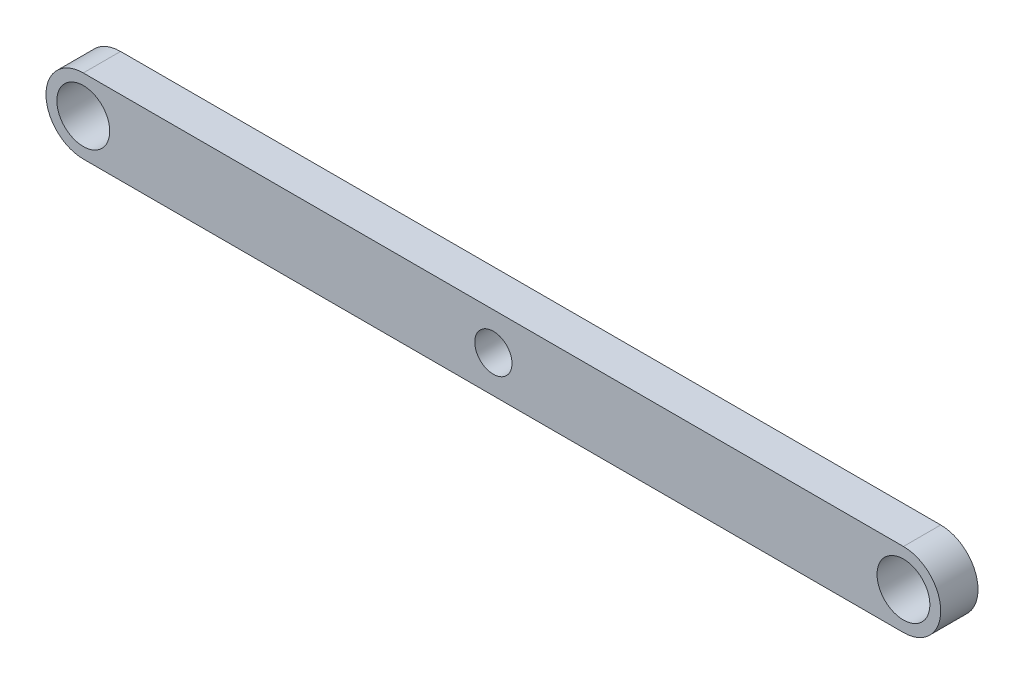
ISO-10303-21;
HEADER;
FILE_DESCRIPTION(('STEP AP214'),'2;1');
FILE_NAME('part.step','',(''),(''),'','','');
FILE_SCHEMA(('AUTOMOTIVE_DESIGN { 1 0 10303 214 1 1 1 1 }'));
ENDSEC;
DATA;
#1=APPLICATION_CONTEXT('core data for automotive mechanical design processes');
#2=APPLICATION_PROTOCOL_DEFINITION('international standard','automotive_design',2000,#1);
#3=PRODUCT_CONTEXT('',#1,'mechanical');
#4=PRODUCT('Part','Part','',(#3));
#5=PRODUCT_RELATED_PRODUCT_CATEGORY('part','',(#4));
#6=PRODUCT_DEFINITION_FORMATION('','',#4);
#7=PRODUCT_DEFINITION_CONTEXT('part definition',#1,'design');
#8=PRODUCT_DEFINITION('design','',#6,#7);
#9=PRODUCT_DEFINITION_SHAPE('','',#8);
#10=(LENGTH_UNIT() NAMED_UNIT(*) SI_UNIT(.MILLI.,.METRE.));
#11=(NAMED_UNIT(*) PLANE_ANGLE_UNIT() SI_UNIT($,.RADIAN.));
#12=(NAMED_UNIT(*) SI_UNIT($,.STERADIAN.) SOLID_ANGLE_UNIT());
#13=UNCERTAINTY_MEASURE_WITH_UNIT(LENGTH_MEASURE(1.E-05),#10,'distance_accuracy_value','');
#14=(GEOMETRIC_REPRESENTATION_CONTEXT(3) GLOBAL_UNCERTAINTY_ASSIGNED_CONTEXT((#13)) GLOBAL_UNIT_ASSIGNED_CONTEXT((#10,
#11,#12)) REPRESENTATION_CONTEXT('',''));
#15=CARTESIAN_POINT('',(0.,0.,0.));
#16=DIRECTION('',(0.,0.,1.));
#17=DIRECTION('',(1.,0.,0.));
#18=AXIS2_PLACEMENT_3D('',#15,#16,#17);
#19=CARTESIAN_POINT('',(-69.85,0.,6.35));
#20=DIRECTION('',(0.,0.,1.));
#21=DIRECTION('',(1.,0.,0.));
#22=AXIS2_PLACEMENT_3D('',#19,#20,#21);
#23=PLANE('',#22);
#24=CARTESIAN_POINT('',(69.85,0.,6.35));
#25=DIRECTION('',(0.,0.,1.));
#26=DIRECTION('',(1.,0.,0.));
#27=AXIS2_PLACEMENT_3D('',#24,#25,#26);
#28=CIRCLE('',#27,4.50000000000002);
#29=CARTESIAN_POINT('',(74.35,0.,6.35));
#30=VERTEX_POINT('',#29);
#31=EDGE_CURVE('E138',#30,#30,#28,.T.);
#32=ORIENTED_EDGE('',*,*,#31,.F.);
#33=EDGE_LOOP('',(#32));
#34=FACE_BOUND('',#33,.T.);
#35=CARTESIAN_POINT('',(-69.85,0.,6.35));
#36=DIRECTION('',(0.,0.,1.));
#37=DIRECTION('',(1.,0.,0.));
#38=AXIS2_PLACEMENT_3D('',#35,#36,#37);
#39=CIRCLE('',#38,6.35);
#40=CARTESIAN_POINT('',(-69.85,6.35,6.35));
#41=VERTEX_POINT('',#40);
#42=CARTESIAN_POINT('',(-69.85,-6.35,6.35));
#43=VERTEX_POINT('',#42);
#44=EDGE_CURVE('E96',#41,#43,#39,.T.);
#45=ORIENTED_EDGE('',*,*,#44,.T.);
#46=DIRECTION('',(1.,0.,0.));
#47=VECTOR('',#46,1.);
#48=CARTESIAN_POINT('',(-69.85,-6.35,6.35));
#49=LINE('',#48,#47);
#50=CARTESIAN_POINT('',(69.85,-6.34999999999997,6.35));
#51=VERTEX_POINT('',#50);
#52=EDGE_CURVE('E91',#43,#51,#49,.T.);
#53=ORIENTED_EDGE('',*,*,#52,.T.);
#54=CARTESIAN_POINT('',(69.85,0.,6.35));
#55=DIRECTION('',(0.,0.,1.));
#56=DIRECTION('',(1.,0.,0.));
#57=AXIS2_PLACEMENT_3D('',#54,#55,#56);
#58=CIRCLE('',#57,6.35);
#59=CARTESIAN_POINT('',(69.85,6.35000000000003,6.35));
#60=VERTEX_POINT('',#59);
#61=EDGE_CURVE('E94',#51,#60,#58,.T.);
#62=ORIENTED_EDGE('',*,*,#61,.T.);
#63=DIRECTION('',(-1.,0.,0.));
#64=VECTOR('',#63,1.);
#65=CARTESIAN_POINT('',(-69.85,6.35,6.35));
#66=LINE('',#65,#64);
#67=EDGE_CURVE('E61',#60,#41,#66,.T.);
#68=ORIENTED_EDGE('',*,*,#67,.T.);
#69=EDGE_LOOP('',(#45,#53,#62,#68));
#70=FACE_BOUND('',#69,.T.);
#71=CARTESIAN_POINT('',(-69.85,0.,6.35));
#72=DIRECTION('',(0.,0.,1.));
#73=DIRECTION('',(1.,0.,0.));
#74=AXIS2_PLACEMENT_3D('',#71,#72,#73);
#75=CIRCLE('',#74,4.5);
#76=CARTESIAN_POINT('',(-65.35,0.,6.35));
#77=VERTEX_POINT('',#76);
#78=EDGE_CURVE('E116',#77,#77,#75,.T.);
#79=ORIENTED_EDGE('',*,*,#78,.F.);
#80=EDGE_LOOP('',(#79));
#81=FACE_BOUND('',#80,.T.);
#82=CARTESIAN_POINT('',(0.,0.,6.35));
#83=DIRECTION('',(0.,0.,1.));
#84=DIRECTION('',(1.,0.,0.));
#85=AXIS2_PLACEMENT_3D('',#82,#83,#84);
#86=CIRCLE('',#85,3.175);
#87=CARTESIAN_POINT('',(3.175,0.,6.35));
#88=VERTEX_POINT('',#87);
#89=EDGE_CURVE('E146',#88,#88,#86,.T.);
#90=ORIENTED_EDGE('',*,*,#89,.F.);
#91=EDGE_LOOP('',(#90));
#92=FACE_BOUND('',#91,.T.);
#93=ADVANCED_FACE('F43',(#34,#70,#81,#92),#23,.T.);
#94=CARTESIAN_POINT('',(-69.85,0.,0.));
#95=DIRECTION('',(0.,0.,1.));
#96=DIRECTION('',(1.,0.,0.));
#97=AXIS2_PLACEMENT_3D('',#94,#95,#96);
#98=PLANE('',#97);
#99=CARTESIAN_POINT('',(-69.85,0.,0.));
#100=DIRECTION('',(0.,0.,1.));
#101=DIRECTION('',(1.,0.,0.));
#102=AXIS2_PLACEMENT_3D('',#99,#100,#101);
#103=CIRCLE('',#102,6.35);
#104=CARTESIAN_POINT('',(-69.85,6.35,0.));
#105=VERTEX_POINT('',#104);
#106=CARTESIAN_POINT('',(-69.85,-6.35,0.));
#107=VERTEX_POINT('',#106);
#108=EDGE_CURVE('E112',#105,#107,#103,.T.);
#109=ORIENTED_EDGE('',*,*,#108,.F.);
#110=DIRECTION('',(-1.,0.,0.));
#111=VECTOR('',#110,1.);
#112=CARTESIAN_POINT('',(-69.85,6.35,0.));
#113=LINE('',#112,#111);
#114=CARTESIAN_POINT('',(69.85,6.35000000000003,0.));
#115=VERTEX_POINT('',#114);
#116=EDGE_CURVE('E84',#115,#105,#113,.T.);
#117=ORIENTED_EDGE('',*,*,#116,.F.);
#118=CARTESIAN_POINT('',(69.85,0.,0.));
#119=DIRECTION('',(0.,0.,1.));
#120=DIRECTION('',(1.,0.,0.));
#121=AXIS2_PLACEMENT_3D('',#118,#119,#120);
#122=CIRCLE('',#121,6.35);
#123=CARTESIAN_POINT('',(69.85,-6.34999999999997,0.));
#124=VERTEX_POINT('',#123);
#125=EDGE_CURVE('E78',#124,#115,#122,.T.);
#126=ORIENTED_EDGE('',*,*,#125,.F.);
#127=DIRECTION('',(1.,0.,0.));
#128=VECTOR('',#127,1.);
#129=CARTESIAN_POINT('',(-69.85,-6.35,0.));
#130=LINE('',#129,#128);
#131=EDGE_CURVE('E101',#107,#124,#130,.T.);
#132=ORIENTED_EDGE('',*,*,#131,.F.);
#133=EDGE_LOOP('',(#109,#117,#126,#132));
#134=FACE_BOUND('',#133,.T.);
#135=CARTESIAN_POINT('',(-69.85,0.,0.));
#136=DIRECTION('',(0.,0.,1.));
#137=DIRECTION('',(1.,0.,0.));
#138=AXIS2_PLACEMENT_3D('',#135,#136,#137);
#139=CIRCLE('',#138,4.5);
#140=CARTESIAN_POINT('',(-65.35,0.,0.));
#141=VERTEX_POINT('',#140);
#142=EDGE_CURVE('E134',#141,#141,#139,.T.);
#143=ORIENTED_EDGE('',*,*,#142,.T.);
#144=EDGE_LOOP('',(#143));
#145=FACE_BOUND('',#144,.T.);
#146=CARTESIAN_POINT('',(69.85,0.,0.));
#147=DIRECTION('',(0.,0.,1.));
#148=DIRECTION('',(1.,0.,0.));
#149=AXIS2_PLACEMENT_3D('',#146,#147,#148);
#150=CIRCLE('',#149,4.50000000000002);
#151=CARTESIAN_POINT('',(74.35,0.,0.));
#152=VERTEX_POINT('',#151);
#153=EDGE_CURVE('E142',#152,#152,#150,.T.);
#154=ORIENTED_EDGE('',*,*,#153,.T.);
#155=EDGE_LOOP('',(#154));
#156=FACE_BOUND('',#155,.T.);
#157=CARTESIAN_POINT('',(0.,0.,0.));
#158=DIRECTION('',(0.,0.,1.));
#159=DIRECTION('',(1.,0.,0.));
#160=AXIS2_PLACEMENT_3D('',#157,#158,#159);
#161=CIRCLE('',#160,3.175);
#162=CARTESIAN_POINT('',(3.175,0.,0.));
#163=VERTEX_POINT('',#162);
#164=EDGE_CURVE('E150',#163,#163,#161,.T.);
#165=ORIENTED_EDGE('',*,*,#164,.T.);
#166=EDGE_LOOP('',(#165));
#167=FACE_BOUND('',#166,.T.);
#168=ADVANCED_FACE('F129',(#134,#145,#156,#167),#98,.F.);
#169=CARTESIAN_POINT('',(-69.85,0.,6.35));
#170=DIRECTION('',(0.,0.,-1.));
#171=DIRECTION('',(-1.,0.,0.));
#172=AXIS2_PLACEMENT_3D('',#169,#170,#171);
#173=CYLINDRICAL_SURFACE('',#172,6.35);
#174=ORIENTED_EDGE('',*,*,#108,.T.);
#175=DIRECTION('',(0.,0.,-1.));
#176=VECTOR('',#175,1.);
#177=CARTESIAN_POINT('',(-69.85,-6.35,6.35));
#178=LINE('',#177,#176);
#179=EDGE_CURVE('E11',#43,#107,#178,.T.);
#180=ORIENTED_EDGE('',*,*,#179,.F.);
#181=ORIENTED_EDGE('',*,*,#44,.F.);
#182=DIRECTION('',(0.,0.,-1.));
#183=VECTOR('',#182,1.);
#184=CARTESIAN_POINT('',(-69.85,6.35,6.35));
#185=LINE('',#184,#183);
#186=EDGE_CURVE('E108',#41,#105,#185,.T.);
#187=ORIENTED_EDGE('',*,*,#186,.T.);
#188=EDGE_LOOP('',(#174,#180,#181,#187));
#189=FACE_BOUND('',#188,.T.);
#190=ADVANCED_FACE('F45',(#189),#173,.T.);
#191=CARTESIAN_POINT('',(-69.85,-6.35,6.35));
#192=DIRECTION('',(0.,1.,0.));
#193=DIRECTION('',(-1.,0.,0.));
#194=AXIS2_PLACEMENT_3D('',#191,#192,#193);
#195=PLANE('',#194);
#196=ORIENTED_EDGE('',*,*,#131,.T.);
#197=DIRECTION('',(0.,0.,-1.));
#198=VECTOR('',#197,1.);
#199=CARTESIAN_POINT('',(69.85,-6.34999999999997,6.35));
#200=LINE('',#199,#198);
#201=EDGE_CURVE('E53',#51,#124,#200,.T.);
#202=ORIENTED_EDGE('',*,*,#201,.F.);
#203=ORIENTED_EDGE('',*,*,#52,.F.);
#204=ORIENTED_EDGE('',*,*,#179,.T.);
#205=EDGE_LOOP('',(#196,#202,#203,#204));
#206=FACE_BOUND('',#205,.T.);
#207=ADVANCED_FACE('F100',(#206),#195,.F.);
#208=CARTESIAN_POINT('',(69.85,0.,6.35));
#209=DIRECTION('',(0.,0.,-1.));
#210=DIRECTION('',(-1.,0.,0.));
#211=AXIS2_PLACEMENT_3D('',#208,#209,#210);
#212=CYLINDRICAL_SURFACE('',#211,6.35);
#213=ORIENTED_EDGE('',*,*,#125,.T.);
#214=DIRECTION('',(0.,0.,-1.));
#215=VECTOR('',#214,1.);
#216=CARTESIAN_POINT('',(69.85,6.35000000000003,6.35));
#217=LINE('',#216,#215);
#218=EDGE_CURVE('E103',#60,#115,#217,.T.);
#219=ORIENTED_EDGE('',*,*,#218,.F.);
#220=ORIENTED_EDGE('',*,*,#61,.F.);
#221=ORIENTED_EDGE('',*,*,#201,.T.);
#222=EDGE_LOOP('',(#213,#219,#220,#221));
#223=FACE_BOUND('',#222,.T.);
#224=ADVANCED_FACE('F104',(#223),#212,.T.);
#225=CARTESIAN_POINT('',(-69.85,6.35,6.35));
#226=DIRECTION('',(0.,-1.,0.));
#227=DIRECTION('',(1.,0.,0.));
#228=AXIS2_PLACEMENT_3D('',#225,#226,#227);
#229=PLANE('',#228);
#230=ORIENTED_EDGE('',*,*,#116,.T.);
#231=ORIENTED_EDGE('',*,*,#186,.F.);
#232=ORIENTED_EDGE('',*,*,#67,.F.);
#233=ORIENTED_EDGE('',*,*,#218,.T.);
#234=EDGE_LOOP('',(#230,#231,#232,#233));
#235=FACE_BOUND('',#234,.T.);
#236=ADVANCED_FACE('F126',(#235),#229,.F.);
#237=CARTESIAN_POINT('',(-69.85,0.,6.35));
#238=DIRECTION('',(0.,0.,-1.));
#239=DIRECTION('',(-1.,0.,0.));
#240=AXIS2_PLACEMENT_3D('',#237,#238,#239);
#241=CYLINDRICAL_SURFACE('',#240,4.5);
#242=ORIENTED_EDGE('',*,*,#78,.T.);
#243=EDGE_LOOP('',(#242));
#244=FACE_BOUND('',#243,.T.);
#245=ORIENTED_EDGE('',*,*,#142,.F.);
#246=EDGE_LOOP('',(#245));
#247=FACE_BOUND('',#246,.T.);
#248=ADVANCED_FACE('F170',(#244,#247),#241,.F.);
#249=CARTESIAN_POINT('',(69.85,0.,6.35));
#250=DIRECTION('',(0.,0.,-1.));
#251=DIRECTION('',(-1.,0.,0.));
#252=AXIS2_PLACEMENT_3D('',#249,#250,#251);
#253=CYLINDRICAL_SURFACE('',#252,4.50000000000002);
#254=ORIENTED_EDGE('',*,*,#31,.T.);
#255=EDGE_LOOP('',(#254));
#256=FACE_BOUND('',#255,.T.);
#257=ORIENTED_EDGE('',*,*,#153,.F.);
#258=EDGE_LOOP('',(#257));
#259=FACE_BOUND('',#258,.T.);
#260=ADVANCED_FACE('F224',(#256,#259),#253,.F.);
#261=CARTESIAN_POINT('',(0.,0.,6.35));
#262=DIRECTION('',(0.,0.,-1.));
#263=DIRECTION('',(-1.,0.,0.));
#264=AXIS2_PLACEMENT_3D('',#261,#262,#263);
#265=CYLINDRICAL_SURFACE('',#264,3.175);
#266=ORIENTED_EDGE('',*,*,#89,.T.);
#267=EDGE_LOOP('',(#266));
#268=FACE_BOUND('',#267,.T.);
#269=ORIENTED_EDGE('',*,*,#164,.F.);
#270=EDGE_LOOP('',(#269));
#271=FACE_BOUND('',#270,.T.);
#272=ADVANCED_FACE('F158',(#268,#271),#265,.F.);
#273=CLOSED_SHELL('',(#93,#168,#190,#207,#224,#236,#248,#260,#272));
#274=MANIFOLD_SOLID_BREP('B2',#273);
#275=ADVANCED_BREP_SHAPE_REPRESENTATION('',(#18,#274),#14);
#276=SHAPE_DEFINITION_REPRESENTATION(#9,#275);
ENDSEC;
END-ISO-10303-21;
